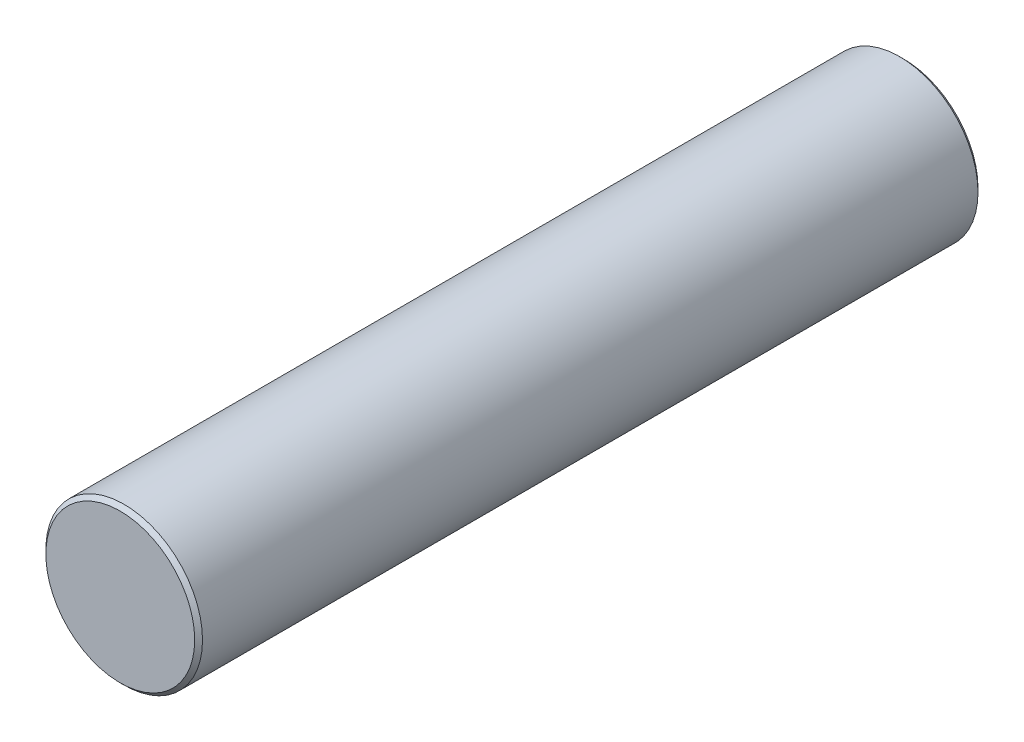
ISO-10303-21;
HEADER;
FILE_DESCRIPTION(('STEP AP214'),'2;1');
FILE_NAME('part.step','',(''),(''),'','','');
FILE_SCHEMA(('AUTOMOTIVE_DESIGN { 1 0 10303 214 1 1 1 1 }'));
ENDSEC;
DATA;
#1=APPLICATION_CONTEXT('core data for automotive mechanical design processes');
#2=APPLICATION_PROTOCOL_DEFINITION('international standard','automotive_design',2000,#1);
#3=PRODUCT_CONTEXT('',#1,'mechanical');
#4=PRODUCT('Part','Part','',(#3));
#5=PRODUCT_RELATED_PRODUCT_CATEGORY('part','',(#4));
#6=PRODUCT_DEFINITION_FORMATION('','',#4);
#7=PRODUCT_DEFINITION_CONTEXT('part definition',#1,'design');
#8=PRODUCT_DEFINITION('design','',#6,#7);
#9=PRODUCT_DEFINITION_SHAPE('','',#8);
#10=(LENGTH_UNIT() NAMED_UNIT(*) SI_UNIT(.MILLI.,.METRE.));
#11=(NAMED_UNIT(*) PLANE_ANGLE_UNIT() SI_UNIT($,.RADIAN.));
#12=(NAMED_UNIT(*) SI_UNIT($,.STERADIAN.) SOLID_ANGLE_UNIT());
#13=UNCERTAINTY_MEASURE_WITH_UNIT(LENGTH_MEASURE(1.E-05),#10,'distance_accuracy_value','');
#14=(GEOMETRIC_REPRESENTATION_CONTEXT(3) GLOBAL_UNCERTAINTY_ASSIGNED_CONTEXT((#13)) GLOBAL_UNIT_ASSIGNED_CONTEXT((#10,
#11,#12)) REPRESENTATION_CONTEXT('',''));
#15=CARTESIAN_POINT('',(0.,0.,0.));
#16=DIRECTION('',(0.,0.,1.));
#17=DIRECTION('',(1.,0.,0.));
#18=AXIS2_PLACEMENT_3D('',#15,#16,#17);
#19=CARTESIAN_POINT('',(0.,0.,200.));
#20=DIRECTION('',(0.,0.,-1.));
#21=DIRECTION('',(-1.,0.,0.));
#22=AXIS2_PLACEMENT_3D('',#19,#20,#21);
#23=CYLINDRICAL_SURFACE('',#22,20.);
#24=CARTESIAN_POINT('',(0.,0.,1.00000000000003));
#25=DIRECTION('',(0.,0.,1.));
#26=DIRECTION('',(1.,0.,0.));
#27=AXIS2_PLACEMENT_3D('',#24,#25,#26);
#28=CIRCLE('',#27,20.);
#29=CARTESIAN_POINT('',(20.,0.,1.00000000000003));
#30=VERTEX_POINT('',#29);
#31=EDGE_CURVE('E47',#30,#30,#28,.T.);
#32=ORIENTED_EDGE('',*,*,#31,.T.);
#33=EDGE_LOOP('',(#32));
#34=FACE_BOUND('',#33,.T.);
#35=CARTESIAN_POINT('',(0.,0.,199.));
#36=DIRECTION('',(0.,0.,1.));
#37=DIRECTION('',(1.,0.,0.));
#38=AXIS2_PLACEMENT_3D('',#35,#36,#37);
#39=CIRCLE('',#38,20.);
#40=CARTESIAN_POINT('',(20.,0.,199.));
#41=VERTEX_POINT('',#40);
#42=EDGE_CURVE('E51',#41,#41,#39,.F.);
#43=ORIENTED_EDGE('',*,*,#42,.T.);
#44=EDGE_LOOP('',(#43));
#45=FACE_BOUND('',#44,.T.);
#46=ADVANCED_FACE('F36',(#34,#45),#23,.T.);
#47=CARTESIAN_POINT('',(0.,0.,200.));
#48=DIRECTION('',(0.,0.,1.));
#49=DIRECTION('',(1.,0.,0.));
#50=AXIS2_PLACEMENT_3D('',#47,#48,#49);
#51=PLANE('',#50);
#52=CARTESIAN_POINT('',(0.,0.,200.));
#53=DIRECTION('',(0.,0.,1.));
#54=DIRECTION('',(1.,0.,0.));
#55=AXIS2_PLACEMENT_3D('',#52,#53,#54);
#56=CIRCLE('',#55,19.);
#57=CARTESIAN_POINT('',(19.,0.,200.));
#58=VERTEX_POINT('',#57);
#59=EDGE_CURVE('E10',#58,#58,#56,.T.);
#60=ORIENTED_EDGE('',*,*,#59,.T.);
#61=EDGE_LOOP('',(#60));
#62=FACE_BOUND('',#61,.T.);
#63=ADVANCED_FACE('F67',(#62),#51,.T.);
#64=CARTESIAN_POINT('',(0.,0.,0.));
#65=DIRECTION('',(0.,0.,1.));
#66=DIRECTION('',(1.,0.,0.));
#67=AXIS2_PLACEMENT_3D('',#64,#65,#66);
#68=PLANE('',#67);
#69=CARTESIAN_POINT('',(0.,0.,0.));
#70=DIRECTION('',(0.,0.,1.));
#71=DIRECTION('',(1.,0.,0.));
#72=AXIS2_PLACEMENT_3D('',#69,#70,#71);
#73=CIRCLE('',#72,19.);
#74=CARTESIAN_POINT('',(19.,0.,0.));
#75=VERTEX_POINT('',#74);
#76=EDGE_CURVE('E43',#75,#75,#73,.F.);
#77=ORIENTED_EDGE('',*,*,#76,.T.);
#78=EDGE_LOOP('',(#77));
#79=FACE_BOUND('',#78,.T.);
#80=ADVANCED_FACE('F64',(#79),#68,.F.);
#81=CARTESIAN_POINT('',(0.,0.,1.00000000000003));
#82=DIRECTION('',(0.,0.,1.));
#83=DIRECTION('',(1.,0.,0.));
#84=AXIS2_PLACEMENT_3D('',#81,#82,#83);
#85=CONICAL_SURFACE('',#84,20.,0.785398163397454);
#86=ORIENTED_EDGE('',*,*,#76,.F.);
#87=EDGE_LOOP('',(#86));
#88=FACE_BOUND('',#87,.T.);
#89=ORIENTED_EDGE('',*,*,#31,.F.);
#90=EDGE_LOOP('',(#89));
#91=FACE_BOUND('',#90,.T.);
#92=ADVANCED_FACE('F60',(#88,#91),#85,.T.);
#93=CARTESIAN_POINT('',(0.,0.,200.));
#94=DIRECTION('',(0.,0.,-1.));
#95=DIRECTION('',(-1.,0.,0.));
#96=AXIS2_PLACEMENT_3D('',#93,#94,#95);
#97=CONICAL_SURFACE('',#96,19.,0.785398163397454);
#98=ORIENTED_EDGE('',*,*,#42,.F.);
#99=EDGE_LOOP('',(#98));
#100=FACE_BOUND('',#99,.T.);
#101=ORIENTED_EDGE('',*,*,#59,.F.);
#102=EDGE_LOOP('',(#101));
#103=FACE_BOUND('',#102,.T.);
#104=ADVANCED_FACE('F38',(#100,#103),#97,.T.);
#105=CLOSED_SHELL('',(#46,#63,#80,#92,#104));
#106=MANIFOLD_SOLID_BREP('B2',#105);
#107=ADVANCED_BREP_SHAPE_REPRESENTATION('',(#18,#106),#14);
#108=SHAPE_DEFINITION_REPRESENTATION(#9,#107);
ENDSEC;
END-ISO-10303-21;
